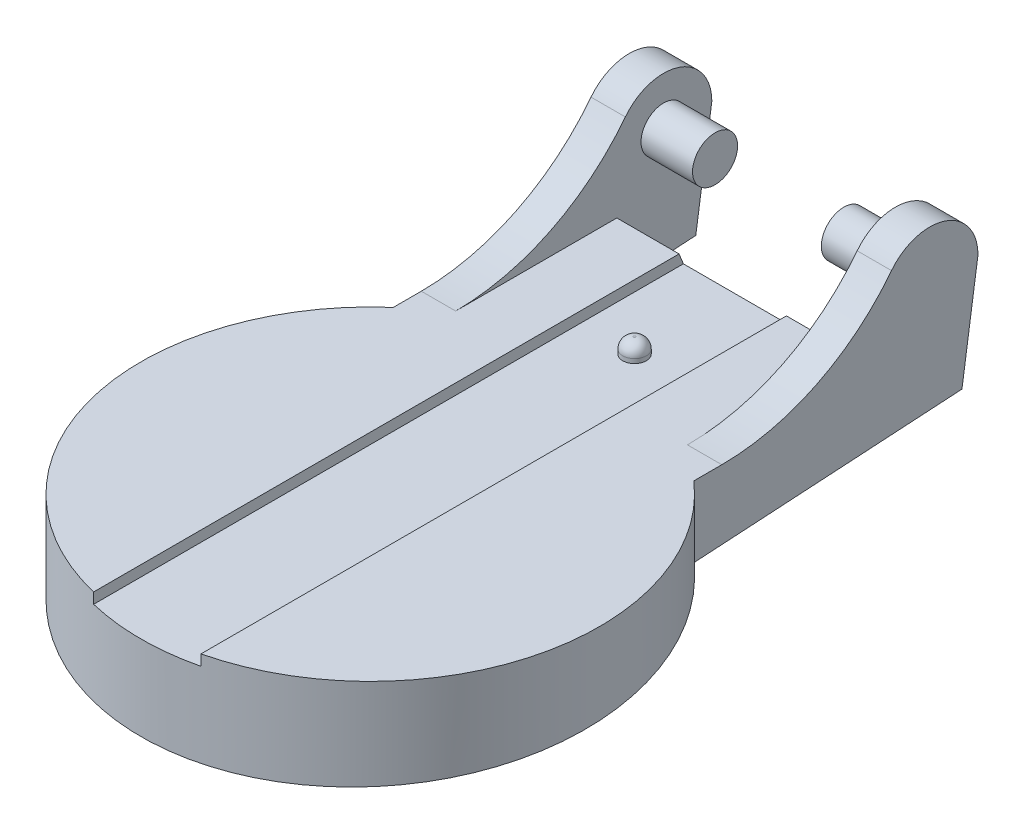
ISO-10303-21;
HEADER;
FILE_DESCRIPTION(('STEP AP214'),'2;1');
FILE_NAME('part.step','',(''),(''),'','','');
FILE_SCHEMA(('AUTOMOTIVE_DESIGN { 1 0 10303 214 1 1 1 1 }'));
ENDSEC;
DATA;
#1=APPLICATION_CONTEXT('core data for automotive mechanical design processes');
#2=APPLICATION_PROTOCOL_DEFINITION('international standard','automotive_design',2000,#1);
#3=PRODUCT_CONTEXT('',#1,'mechanical');
#4=PRODUCT('Part','Part','',(#3));
#5=PRODUCT_RELATED_PRODUCT_CATEGORY('part','',(#4));
#6=PRODUCT_DEFINITION_FORMATION('','',#4);
#7=PRODUCT_DEFINITION_CONTEXT('part definition',#1,'design');
#8=PRODUCT_DEFINITION('design','',#6,#7);
#9=PRODUCT_DEFINITION_SHAPE('','',#8);
#10=(LENGTH_UNIT() NAMED_UNIT(*) SI_UNIT(.MILLI.,.METRE.));
#11=(NAMED_UNIT(*) PLANE_ANGLE_UNIT() SI_UNIT($,.RADIAN.));
#12=(NAMED_UNIT(*) SI_UNIT($,.STERADIAN.) SOLID_ANGLE_UNIT());
#13=UNCERTAINTY_MEASURE_WITH_UNIT(LENGTH_MEASURE(1.E-05),#10,'distance_accuracy_value','');
#14=(GEOMETRIC_REPRESENTATION_CONTEXT(3) GLOBAL_UNCERTAINTY_ASSIGNED_CONTEXT((#13)) GLOBAL_UNIT_ASSIGNED_CONTEXT((#10,
#11,#12)) REPRESENTATION_CONTEXT('',''));
#15=CARTESIAN_POINT('',(0.,0.,0.));
#16=DIRECTION('',(0.,0.,1.));
#17=DIRECTION('',(1.,0.,0.));
#18=AXIS2_PLACEMENT_3D('',#15,#16,#17);
#19=CARTESIAN_POINT('',(0.,5.,0.));
#20=DIRECTION('',(0.,1.,0.));
#21=DIRECTION('',(0.,0.,1.));
#22=AXIS2_PLACEMENT_3D('',#19,#20,#21);
#23=PLANE('',#22);
#24=DIRECTION('',(0.,0.,-1.));
#25=VECTOR('',#24,1.);
#26=CARTESIAN_POINT('',(5.4,5.,-9.26221822783077));
#27=LINE('',#26,#25);
#28=CARTESIAN_POINT('',(5.4,5.,-3.06431468609474));
#29=VERTEX_POINT('',#28);
#30=CARTESIAN_POINT('',(5.4,5.,-10.5737971615211));
#31=VERTEX_POINT('',#30);
#32=EDGE_CURVE('E348',#29,#31,#27,.T.);
#33=ORIENTED_EDGE('',*,*,#32,.T.);
#34=DIRECTION('',(-1.,0.,0.));
#35=VECTOR('',#34,1.);
#36=CARTESIAN_POINT('',(0.,5.,-10.5737971615211));
#37=LINE('',#36,#35);
#38=CARTESIAN_POINT('',(2.5,5.,-10.5737971615212));
#39=VERTEX_POINT('',#38);
#40=EDGE_CURVE('E315',#31,#39,#37,.T.);
#41=ORIENTED_EDGE('',*,*,#40,.T.);
#42=DIRECTION('',(0.,0.,-1.));
#43=VECTOR('',#42,1.);
#44=CARTESIAN_POINT('',(2.5,5.,0.));
#45=LINE('',#44,#43);
#46=CARTESIAN_POINT('',(2.5,5.,16.7017507777364));
#47=VERTEX_POINT('',#46);
#48=EDGE_CURVE('E398',#47,#39,#45,.T.);
#49=ORIENTED_EDGE('',*,*,#48,.F.);
#50=CARTESIAN_POINT('',(0.,5.,6.31426982340599));
#51=DIRECTION('',(0.,1.,0.));
#52=DIRECTION('',(0.,0.,1.));
#53=AXIS2_PLACEMENT_3D('',#50,#51,#52);
#54=CIRCLE('',#53,10.6840891318155);
#55=CARTESIAN_POINT('',(7.,5.,-1.75727033796209));
#56=VERTEX_POINT('',#55);
#57=EDGE_CURVE('E381',#47,#56,#54,.T.);
#58=ORIENTED_EDGE('',*,*,#57,.T.);
#59=DIRECTION('',(0.,0.,1.));
#60=VECTOR('',#59,1.);
#61=CARTESIAN_POINT('',(7.,5.,0.));
#62=LINE('',#61,#60);
#63=CARTESIAN_POINT('',(7.,5.,-3.06431468609474));
#64=VERTEX_POINT('',#63);
#65=EDGE_CURVE('E367',#64,#56,#62,.T.);
#66=ORIENTED_EDGE('',*,*,#65,.F.);
#67=DIRECTION('',(-1.,0.,0.));
#68=VECTOR('',#67,1.);
#69=CARTESIAN_POINT('',(0.,5.,-3.06431468609474));
#70=LINE('',#69,#68);
#71=EDGE_CURVE('E418',#64,#29,#70,.T.);
#72=ORIENTED_EDGE('',*,*,#71,.T.);
#73=EDGE_LOOP('',(#33,#41,#49,#58,#66,#72));
#74=FACE_BOUND('',#73,.T.);
#75=ADVANCED_FACE('F164',(#74),#23,.T.);
#76=DIRECTION('',(0.,0.,1.));
#77=VECTOR('',#76,1.);
#78=CARTESIAN_POINT('',(-2.5,5.,0.));
#79=LINE('',#78,#77);
#80=CARTESIAN_POINT('',(-2.5,5.,-10.5737971615212));
#81=VERTEX_POINT('',#80);
#82=CARTESIAN_POINT('',(-2.5,5.,16.7017507777364));
#83=VERTEX_POINT('',#82);
#84=EDGE_CURVE('E396',#81,#83,#79,.T.);
#85=ORIENTED_EDGE('',*,*,#84,.F.);
#86=DIRECTION('',(-1.,0.,0.));
#87=VECTOR('',#86,1.);
#88=CARTESIAN_POINT('',(0.,5.,-10.5737971615211));
#89=LINE('',#88,#87);
#90=CARTESIAN_POINT('',(-5.4,5.,-10.5737971615211));
#91=VERTEX_POINT('',#90);
#92=EDGE_CURVE('E307',#81,#91,#89,.T.);
#93=ORIENTED_EDGE('',*,*,#92,.T.);
#94=DIRECTION('',(0.,0.,1.));
#95=VECTOR('',#94,1.);
#96=CARTESIAN_POINT('',(-5.4,5.,-9.26221822783077));
#97=LINE('',#96,#95);
#98=CARTESIAN_POINT('',(-5.4,5.,-3.06431468609474));
#99=VERTEX_POINT('',#98);
#100=EDGE_CURVE('E287',#91,#99,#97,.T.);
#101=ORIENTED_EDGE('',*,*,#100,.T.);
#102=DIRECTION('',(1.,0.,0.));
#103=VECTOR('',#102,1.);
#104=CARTESIAN_POINT('',(0.,5.,-3.06431468609474));
#105=LINE('',#104,#103);
#106=CARTESIAN_POINT('',(-7.,5.,-3.06431468609474));
#107=VERTEX_POINT('',#106);
#108=EDGE_CURVE('E412',#99,#107,#105,.F.);
#109=ORIENTED_EDGE('',*,*,#108,.T.);
#110=DIRECTION('',(0.,0.,-1.));
#111=VECTOR('',#110,1.);
#112=CARTESIAN_POINT('',(-7.,5.,9.53699339238767));
#113=LINE('',#112,#111);
#114=CARTESIAN_POINT('',(-7.,5.,-1.75727033796209));
#115=VERTEX_POINT('',#114);
#116=EDGE_CURVE('E354',#115,#107,#113,.T.);
#117=ORIENTED_EDGE('',*,*,#116,.F.);
#118=EDGE_CURVE('E382',#115,#83,#54,.T.);
#119=ORIENTED_EDGE('',*,*,#118,.T.);
#120=EDGE_LOOP('',(#85,#93,#101,#109,#117,#119));
#121=FACE_BOUND('',#120,.T.);
#122=ADVANCED_FACE('F444',(#121),#23,.T.);
#123=CARTESIAN_POINT('',(10.6840891318155,2.5,-15.));
#124=DIRECTION('',(0.,0.998164741139127,0.0605569942010037));
#125=DIRECTION('',(0.,-0.0605569942010037,0.998164741139127));
#126=AXIS2_PLACEMENT_3D('',#123,#124,#125);
#127=PLANE('',#126);
#128=DIRECTION('',(0.,0.0605569942010037,-0.998164741139127));
#129=VECTOR('',#128,1.);
#130=CARTESIAN_POINT('',(-5.4,2.5,-15.));
#131=LINE('',#130,#129);
#132=CARTESIAN_POINT('',(-5.4,2.29727597325408,-11.6584871268897));
#133=VERTEX_POINT('',#132);
#134=CARTESIAN_POINT('',(-5.4,2.45465107455214,-14.252510811875));
#135=VERTEX_POINT('',#134);
#136=EDGE_CURVE('E284',#133,#135,#131,.T.);
#137=ORIENTED_EDGE('',*,*,#136,.F.);
#138=DIRECTION('',(-1.,0.,0.));
#139=VECTOR('',#138,1.);
#140=CARTESIAN_POINT('',(13.6652872861874,2.29727597325408,-11.6584871268897));
#141=LINE('',#140,#139);
#142=CARTESIAN_POINT('',(5.4,2.29727597325408,-11.6584871268897));
#143=VERTEX_POINT('',#142);
#144=EDGE_CURVE('E290',#143,#133,#141,.T.);
#145=ORIENTED_EDGE('',*,*,#144,.F.);
#146=DIRECTION('',(0.,-0.0605569942010037,0.998164741139127));
#147=VECTOR('',#146,1.);
#148=CARTESIAN_POINT('',(5.4,2.5,-15.));
#149=LINE('',#148,#147);
#150=CARTESIAN_POINT('',(5.4,2.45465107455214,-14.252510811875));
#151=VERTEX_POINT('',#150);
#152=EDGE_CURVE('E304',#151,#143,#149,.T.);
#153=ORIENTED_EDGE('',*,*,#152,.F.);
#154=DIRECTION('',(-1.,0.,0.));
#155=VECTOR('',#154,1.);
#156=CARTESIAN_POINT('',(10.6840891318155,2.45465107455214,-14.252510811875));
#157=LINE('',#156,#155);
#158=CARTESIAN_POINT('',(7.,2.45465107455214,-14.252510811875));
#159=VERTEX_POINT('',#158);
#160=EDGE_CURVE('E321',#159,#151,#157,.T.);
#161=ORIENTED_EDGE('',*,*,#160,.F.);
#162=DIRECTION('',(0.,0.0605569942010038,-0.998164741139127));
#163=VECTOR('',#162,1.);
#164=CARTESIAN_POINT('',(7.,1.58414427952122,0.0961073979021152));
#165=LINE('',#164,#163);
#166=CARTESIAN_POINT('',(7.,1.69658562329671,-1.75727033796209));
#167=VERTEX_POINT('',#166);
#168=EDGE_CURVE('E369',#167,#159,#165,.T.);
#169=ORIENTED_EDGE('',*,*,#168,.F.);
#170=CARTESIAN_POINT('',(0.,1.20689871030546,6.31426982340599));
#171=DIRECTION('',(0.,0.998164741139127,0.0605569942010037));
#172=DIRECTION('',(0.,-0.0605569942010037,0.998164741139127));
#173=AXIS2_PLACEMENT_3D('',#170,#171,#172);
#174=ELLIPSE('',#173,10.7037332531127,10.6840891318155);
#175=CARTESIAN_POINT('',(-7.,1.69658562329671,-1.75727033796209));
#176=VERTEX_POINT('',#175);
#177=EDGE_CURVE('E379',#176,#167,#174,.T.);
#178=ORIENTED_EDGE('',*,*,#177,.F.);
#179=DIRECTION('',(0.,-0.0605569942010038,0.998164741139127));
#180=VECTOR('',#179,1.);
#181=CARTESIAN_POINT('',(-7.,1.58414427952122,0.0961073979021152));
#182=LINE('',#181,#180);
#183=CARTESIAN_POINT('',(-7.,2.45465107455214,-14.252510811875));
#184=VERTEX_POINT('',#183);
#185=EDGE_CURVE('E357',#184,#176,#182,.T.);
#186=ORIENTED_EDGE('',*,*,#185,.F.);
#187=EDGE_CURVE('E302',#135,#184,#157,.T.);
#188=ORIENTED_EDGE('',*,*,#187,.F.);
#189=EDGE_LOOP('',(#137,#145,#153,#161,#169,#178,#186,#188));
#190=FACE_BOUND('',#189,.T.);
#191=ADVANCED_FACE('F300',(#190),#127,.F.);
#192=CARTESIAN_POINT('',(0.,4.5,0.));
#193=DIRECTION('',(0.,1.,0.));
#194=DIRECTION('',(0.,0.,1.));
#195=AXIS2_PLACEMENT_3D('',#192,#193,#194);
#196=PLANE('',#195);
#197=CARTESIAN_POINT('',(0.,4.5,-6.));
#198=DIRECTION('',(0.,1.,0.));
#199=DIRECTION('',(0.,0.,1.));
#200=AXIS2_PLACEMENT_3D('',#197,#198,#199);
#201=CIRCLE('',#200,0.550000000000003);
#202=CARTESIAN_POINT('',(0.,4.5,-5.45));
#203=VERTEX_POINT('',#202);
#204=EDGE_CURVE('E330',#203,#203,#201,.T.);
#205=ORIENTED_EDGE('',*,*,#204,.F.);
#206=EDGE_LOOP('',(#205));
#207=FACE_BOUND('',#206,.T.);
#208=DIRECTION('',(0.,0.,-1.));
#209=VECTOR('',#208,1.);
#210=CARTESIAN_POINT('',(2.5,4.5,-52.5680480525767));
#211=LINE('',#210,#209);
#212=CARTESIAN_POINT('',(2.5,4.5,16.7017507777364));
#213=VERTEX_POINT('',#212);
#214=CARTESIAN_POINT('',(2.5,4.5,-10.77446322188));
#215=VERTEX_POINT('',#214);
#216=EDGE_CURVE('E333',#213,#215,#211,.T.);
#217=ORIENTED_EDGE('',*,*,#216,.T.);
#218=DIRECTION('',(-1.,0.,0.));
#219=VECTOR('',#218,1.);
#220=CARTESIAN_POINT('',(0.,4.5,-10.77446322188));
#221=LINE('',#220,#219);
#222=CARTESIAN_POINT('',(-2.5,4.5,-10.77446322188));
#223=VERTEX_POINT('',#222);
#224=EDGE_CURVE('E303',#215,#223,#221,.T.);
#225=ORIENTED_EDGE('',*,*,#224,.T.);
#226=DIRECTION('',(0.,0.,1.));
#227=VECTOR('',#226,1.);
#228=CARTESIAN_POINT('',(-2.5,4.5,-52.5680480525767));
#229=LINE('',#228,#227);
#230=CARTESIAN_POINT('',(-2.5,4.5,16.7017507777364));
#231=VERTEX_POINT('',#230);
#232=EDGE_CURVE('E336',#223,#231,#229,.T.);
#233=ORIENTED_EDGE('',*,*,#232,.T.);
#234=CARTESIAN_POINT('',(0.,4.5,6.31426982340599));
#235=DIRECTION('',(0.,1.,0.));
#236=DIRECTION('',(0.,0.,1.));
#237=AXIS2_PLACEMENT_3D('',#234,#235,#236);
#238=CIRCLE('',#237,10.6840891318155);
#239=EDGE_CURVE('E401',#231,#213,#238,.T.);
#240=ORIENTED_EDGE('',*,*,#239,.T.);
#241=EDGE_LOOP('',(#217,#225,#233,#240));
#242=FACE_BOUND('',#241,.T.);
#243=ADVANCED_FACE('F494',(#207,#242),#196,.T.);
#244=CARTESIAN_POINT('',(2.5,4.5,-52.5680480525767));
#245=DIRECTION('',(1.,0.,0.));
#246=DIRECTION('',(0.,0.,-1.));
#247=AXIS2_PLACEMENT_3D('',#244,#245,#246);
#248=PLANE('',#247);
#249=DIRECTION('',(0.,0.928049777726173,0.372456185426422));
#250=VECTOR('',#249,1.);
#251=CARTESIAN_POINT('',(2.5,-9.94628193426325,-16.5722201870435));
#252=LINE('',#251,#250);
#253=EDGE_CURVE('E313',#215,#39,#252,.T.);
#254=ORIENTED_EDGE('',*,*,#253,.F.);
#255=ORIENTED_EDGE('',*,*,#216,.F.);
#256=DIRECTION('',(0.,-1.,0.));
#257=VECTOR('',#256,1.);
#258=CARTESIAN_POINT('',(2.5,5.,16.7017507777364));
#259=LINE('',#258,#257);
#260=EDGE_CURVE('E341',#47,#213,#259,.T.);
#261=ORIENTED_EDGE('',*,*,#260,.F.);
#262=ORIENTED_EDGE('',*,*,#48,.T.);
#263=EDGE_LOOP('',(#254,#255,#261,#262));
#264=FACE_BOUND('',#263,.T.);
#265=ADVANCED_FACE('F497',(#264),#248,.F.);
#266=CARTESIAN_POINT('',(-2.5,4.5,-52.5680480525767));
#267=DIRECTION('',(-1.,0.,0.));
#268=DIRECTION('',(0.,0.,1.));
#269=AXIS2_PLACEMENT_3D('',#266,#267,#268);
#270=PLANE('',#269);
#271=DIRECTION('',(0.,-0.928049777726173,-0.372456185426422));
#272=VECTOR('',#271,1.);
#273=CARTESIAN_POINT('',(-2.5,-9.94628193426325,-16.5722201870435));
#274=LINE('',#273,#272);
#275=EDGE_CURVE('E12',#81,#223,#274,.T.);
#276=ORIENTED_EDGE('',*,*,#275,.F.);
#277=ORIENTED_EDGE('',*,*,#84,.T.);
#278=DIRECTION('',(0.,-1.,0.));
#279=VECTOR('',#278,1.);
#280=CARTESIAN_POINT('',(-2.5,5.,16.7017507777364));
#281=LINE('',#280,#279);
#282=EDGE_CURVE('E338',#231,#83,#281,.F.);
#283=ORIENTED_EDGE('',*,*,#282,.F.);
#284=ORIENTED_EDGE('',*,*,#232,.F.);
#285=EDGE_LOOP('',(#276,#277,#283,#284));
#286=FACE_BOUND('',#285,.T.);
#287=ADVANCED_FACE('F513',(#286),#270,.F.);
#288=CARTESIAN_POINT('',(10.6840891318155,7.5,-15.));
#289=DIRECTION('',(0.,0.146554433527509,0.989202607160652));
#290=DIRECTION('',(0.,-0.989202607160652,0.146554433527509));
#291=AXIS2_PLACEMENT_3D('',#288,#289,#290);
#292=PLANE('',#291);
#293=DIRECTION('',(0.,-0.989202607160652,0.146554433527509));
#294=VECTOR('',#293,1.);
#295=CARTESIAN_POINT('',(-5.4,33.5775315871492,-18.8634935268925));
#296=LINE('',#295,#294);
#297=CARTESIAN_POINT('',(-5.4,7.5,-15.));
#298=VERTEX_POINT('',#297);
#299=EDGE_CURVE('E324',#298,#135,#296,.T.);
#300=ORIENTED_EDGE('',*,*,#299,.T.);
#301=ORIENTED_EDGE('',*,*,#187,.T.);
#302=DIRECTION('',(0.,0.989202607160652,-0.146554433527509));
#303=VECTOR('',#302,1.);
#304=CARTESIAN_POINT('',(-7.,7.5,-15.));
#305=LINE('',#304,#303);
#306=CARTESIAN_POINT('',(-7.,7.5,-15.));
#307=VERTEX_POINT('',#306);
#308=EDGE_CURVE('E318',#184,#307,#305,.T.);
#309=ORIENTED_EDGE('',*,*,#308,.T.);
#310=DIRECTION('',(1.,0.,0.));
#311=VECTOR('',#310,1.);
#312=CARTESIAN_POINT('',(-7.,7.5,-15.));
#313=LINE('',#312,#311);
#314=EDGE_CURVE('E359',#307,#298,#313,.T.);
#315=ORIENTED_EDGE('',*,*,#314,.T.);
#316=EDGE_LOOP('',(#300,#301,#309,#315));
#317=FACE_BOUND('',#316,.T.);
#318=ADVANCED_FACE('F522',(#317),#292,.F.);
#319=ORIENTED_EDGE('',*,*,#160,.T.);
#320=DIRECTION('',(0.,0.989202607160652,-0.146554433527509));
#321=VECTOR('',#320,1.);
#322=CARTESIAN_POINT('',(5.4,33.5775315871492,-18.8634935268925));
#323=LINE('',#322,#321);
#324=CARTESIAN_POINT('',(5.4,7.5,-15.));
#325=VERTEX_POINT('',#324);
#326=EDGE_CURVE('E326',#151,#325,#323,.T.);
#327=ORIENTED_EDGE('',*,*,#326,.T.);
#328=DIRECTION('',(-1.,0.,0.));
#329=VECTOR('',#328,1.);
#330=CARTESIAN_POINT('',(7.,7.5,-15.));
#331=LINE('',#330,#329);
#332=CARTESIAN_POINT('',(7.,7.5,-15.));
#333=VERTEX_POINT('',#332);
#334=EDGE_CURVE('E372',#333,#325,#331,.T.);
#335=ORIENTED_EDGE('',*,*,#334,.F.);
#336=DIRECTION('',(0.,-0.989202607160652,0.146554433527509));
#337=VECTOR('',#336,1.);
#338=CARTESIAN_POINT('',(7.,-2.0134939011462,-13.5905367621787));
#339=LINE('',#338,#337);
#340=EDGE_CURVE('E328',#333,#159,#339,.T.);
#341=ORIENTED_EDGE('',*,*,#340,.T.);
#342=EDGE_LOOP('',(#319,#327,#335,#341));
#343=FACE_BOUND('',#342,.T.);
#344=ADVANCED_FACE('F475',(#343),#292,.F.);
#345=CARTESIAN_POINT('',(-3.,7.5,-12.75));
#346=DIRECTION('',(-1.,0.,0.));
#347=DIRECTION('',(0.,0.,1.));
#348=AXIS2_PLACEMENT_3D('',#345,#346,#347);
#349=CYLINDRICAL_SURFACE('',#348,1.05);
#350=CARTESIAN_POINT('',(-5.4,7.5,-12.75));
#351=DIRECTION('',(1.,0.,0.));
#352=DIRECTION('',(0.,0.,-1.));
#353=AXIS2_PLACEMENT_3D('',#350,#351,#352);
#354=CIRCLE('',#353,1.05);
#355=CARTESIAN_POINT('',(-5.4,7.5,-13.8));
#356=VERTEX_POINT('',#355);
#357=EDGE_CURVE('E393',#356,#356,#354,.F.);
#358=ORIENTED_EDGE('',*,*,#357,.F.);
#359=EDGE_LOOP('',(#358));
#360=FACE_BOUND('',#359,.T.);
#361=CARTESIAN_POINT('',(-3.,7.5,-12.75));
#362=DIRECTION('',(-1.,0.,0.));
#363=DIRECTION('',(0.,0.,1.));
#364=AXIS2_PLACEMENT_3D('',#361,#362,#363);
#365=CIRCLE('',#364,1.05);
#366=CARTESIAN_POINT('',(-3.,7.5,-11.7));
#367=VERTEX_POINT('',#366);
#368=EDGE_CURVE('E390',#367,#367,#365,.T.);
#369=ORIENTED_EDGE('',*,*,#368,.T.);
#370=EDGE_LOOP('',(#369));
#371=FACE_BOUND('',#370,.T.);
#372=ADVANCED_FACE('F465',(#360,#371),#349,.T.);
#373=CARTESIAN_POINT('',(-3.,7.5,-12.75));
#374=DIRECTION('',(-1.,0.,0.));
#375=DIRECTION('',(0.,0.,1.));
#376=AXIS2_PLACEMENT_3D('',#373,#374,#375);
#377=PLANE('',#376);
#378=ORIENTED_EDGE('',*,*,#368,.F.);
#379=EDGE_LOOP('',(#378));
#380=FACE_BOUND('',#379,.T.);
#381=ADVANCED_FACE('F462',(#380),#377,.F.);
#382=CARTESIAN_POINT('',(-5.4,35.,-9.26221822783077));
#383=DIRECTION('',(1.,0.,0.));
#384=DIRECTION('',(0.,0.,-1.));
#385=AXIS2_PLACEMENT_3D('',#382,#383,#384);
#386=PLANE('',#385);
#387=ORIENTED_EDGE('',*,*,#100,.F.);
#388=DIRECTION('',(0.,-0.928049777726173,-0.372456185426422));
#389=VECTOR('',#388,1.);
#390=CARTESIAN_POINT('',(-5.4,6.05915935724947,-10.1487224904982));
#391=LINE('',#390,#389);
#392=EDGE_CURVE('E278',#91,#133,#391,.T.);
#393=ORIENTED_EDGE('',*,*,#392,.T.);
#394=ORIENTED_EDGE('',*,*,#136,.T.);
#395=ORIENTED_EDGE('',*,*,#299,.F.);
#396=CARTESIAN_POINT('',(-5.4,7.5,-12.75));
#397=DIRECTION('',(1.,0.,0.));
#398=DIRECTION('',(0.,0.,-1.));
#399=AXIS2_PLACEMENT_3D('',#396,#397,#398);
#400=CIRCLE('',#399,2.25);
#401=CARTESIAN_POINT('',(-5.4,8.87755102040817,-10.970996574997));
#402=VERTEX_POINT('',#401);
#403=EDGE_CURVE('E351',#298,#402,#400,.T.);
#404=ORIENTED_EDGE('',*,*,#403,.T.);
#405=CARTESIAN_POINT('',(-5.4,15.,-3.06431468609474));
#406=DIRECTION('',(1.,0.,0.));
#407=DIRECTION('',(0.,0.,-1.));
#408=AXIS2_PLACEMENT_3D('',#405,#406,#407);
#409=CIRCLE('',#408,10.);
#410=EDGE_CURVE('E414',#402,#99,#409,.F.);
#411=ORIENTED_EDGE('',*,*,#410,.T.);
#412=EDGE_LOOP('',(#387,#393,#394,#395,#404,#411));
#413=FACE_BOUND('',#412,.T.);
#414=ORIENTED_EDGE('',*,*,#357,.T.);
#415=EDGE_LOOP('',(#414));
#416=FACE_BOUND('',#415,.T.);
#417=ADVANCED_FACE('F280',(#413,#416),#386,.T.);
#418=CARTESIAN_POINT('',(7.,7.5,-12.75));
#419=DIRECTION('',(-1.,0.,0.));
#420=DIRECTION('',(0.,0.,1.));
#421=AXIS2_PLACEMENT_3D('',#418,#419,#420);
#422=CYLINDRICAL_SURFACE('',#421,2.25);
#423=CARTESIAN_POINT('',(5.4,7.5,-12.75));
#424=DIRECTION('',(-1.,0.,0.));
#425=DIRECTION('',(0.,0.,1.));
#426=AXIS2_PLACEMENT_3D('',#423,#424,#425);
#427=CIRCLE('',#426,2.25);
#428=CARTESIAN_POINT('',(5.4,8.87755102040816,-10.970996574997));
#429=VERTEX_POINT('',#428);
#430=EDGE_CURVE('E385',#429,#325,#427,.T.);
#431=ORIENTED_EDGE('',*,*,#430,.F.);
#432=DIRECTION('',(-1.,0.,0.));
#433=VECTOR('',#432,1.);
#434=CARTESIAN_POINT('',(7.,8.87755102040816,-10.970996574997));
#435=LINE('',#434,#433);
#436=CARTESIAN_POINT('',(7.,8.87755102040816,-10.970996574997));
#437=VERTEX_POINT('',#436);
#438=EDGE_CURVE('E179',#429,#437,#435,.F.);
#439=ORIENTED_EDGE('',*,*,#438,.T.);
#440=CARTESIAN_POINT('',(7.,7.5,-12.75));
#441=DIRECTION('',(1.,0.,0.));
#442=DIRECTION('',(0.,0.,-1.));
#443=AXIS2_PLACEMENT_3D('',#440,#441,#442);
#444=CIRCLE('',#443,2.25);
#445=EDGE_CURVE('E366',#333,#437,#444,.T.);
#446=ORIENTED_EDGE('',*,*,#445,.F.);
#447=ORIENTED_EDGE('',*,*,#334,.T.);
#448=EDGE_LOOP('',(#431,#439,#446,#447));
#449=FACE_BOUND('',#448,.T.);
#450=ADVANCED_FACE('F461',(#449),#422,.T.);
#451=CARTESIAN_POINT('',(-7.,7.5,-12.75));
#452=DIRECTION('',(1.,0.,0.));
#453=DIRECTION('',(0.,0.,-1.));
#454=AXIS2_PLACEMENT_3D('',#451,#452,#453);
#455=CYLINDRICAL_SURFACE('',#454,2.25);
#456=CARTESIAN_POINT('',(-7.,7.5,-12.75));
#457=DIRECTION('',(-1.,0.,0.));
#458=DIRECTION('',(0.,0.,1.));
#459=AXIS2_PLACEMENT_3D('',#456,#457,#458);
#460=CIRCLE('',#459,2.25);
#461=CARTESIAN_POINT('',(-7.,8.87755102040817,-10.970996574997));
#462=VERTEX_POINT('',#461);
#463=EDGE_CURVE('E355',#462,#307,#460,.T.);
#464=ORIENTED_EDGE('',*,*,#463,.F.);
#465=DIRECTION('',(1.,0.,0.));
#466=VECTOR('',#465,1.);
#467=CARTESIAN_POINT('',(-7.,8.87755102040817,-10.970996574997));
#468=LINE('',#467,#466);
#469=EDGE_CURVE('E409',#462,#402,#468,.T.);
#470=ORIENTED_EDGE('',*,*,#469,.T.);
#471=ORIENTED_EDGE('',*,*,#403,.F.);
#472=ORIENTED_EDGE('',*,*,#314,.F.);
#473=EDGE_LOOP('',(#464,#470,#471,#472));
#474=FACE_BOUND('',#473,.T.);
#475=ADVANCED_FACE('F457',(#474),#455,.T.);
#476=CARTESIAN_POINT('',(0.,5.,6.31426982340599));
#477=DIRECTION('',(0.,-1.,0.));
#478=DIRECTION('',(0.,0.,-1.));
#479=AXIS2_PLACEMENT_3D('',#476,#477,#478);
#480=CYLINDRICAL_SURFACE('',#479,10.6840891318155);
#481=ORIENTED_EDGE('',*,*,#57,.F.);
#482=ORIENTED_EDGE('',*,*,#260,.T.);
#483=ORIENTED_EDGE('',*,*,#239,.F.);
#484=ORIENTED_EDGE('',*,*,#282,.T.);
#485=ORIENTED_EDGE('',*,*,#118,.F.);
#486=DIRECTION('',(0.,-1.,0.));
#487=VECTOR('',#486,1.);
#488=CARTESIAN_POINT('',(-7.,5.,-1.75727033796209));
#489=LINE('',#488,#487);
#490=EDGE_CURVE('E361',#115,#176,#489,.T.);
#491=ORIENTED_EDGE('',*,*,#490,.T.);
#492=ORIENTED_EDGE('',*,*,#177,.T.);
#493=DIRECTION('',(0.,-1.,0.));
#494=VECTOR('',#493,1.);
#495=CARTESIAN_POINT('',(7.,5.,-1.75727033796209));
#496=LINE('',#495,#494);
#497=EDGE_CURVE('E375',#167,#56,#496,.F.);
#498=ORIENTED_EDGE('',*,*,#497,.T.);
#499=EDGE_LOOP('',(#481,#482,#483,#484,#485,#491,#492,#498));
#500=FACE_BOUND('',#499,.T.);
#501=ADVANCED_FACE('F454',(#500),#480,.T.);
#502=CARTESIAN_POINT('',(7.,0.,0.));
#503=DIRECTION('',(1.,0.,0.));
#504=DIRECTION('',(0.,0.,-1.));
#505=AXIS2_PLACEMENT_3D('',#502,#503,#504);
#506=PLANE('',#505);
#507=ORIENTED_EDGE('',*,*,#340,.F.);
#508=ORIENTED_EDGE('',*,*,#445,.T.);
#509=CARTESIAN_POINT('',(7.,15.,-3.06431468609474));
#510=DIRECTION('',(1.,0.,0.));
#511=DIRECTION('',(0.,0.,-1.));
#512=AXIS2_PLACEMENT_3D('',#509,#510,#511);
#513=CIRCLE('',#512,10.);
#514=EDGE_CURVE('E172',#437,#64,#513,.F.);
#515=ORIENTED_EDGE('',*,*,#514,.T.);
#516=ORIENTED_EDGE('',*,*,#65,.T.);
#517=ORIENTED_EDGE('',*,*,#497,.F.);
#518=ORIENTED_EDGE('',*,*,#168,.T.);
#519=EDGE_LOOP('',(#507,#508,#515,#516,#517,#518));
#520=FACE_BOUND('',#519,.T.);
#521=ADVANCED_FACE('F426',(#520),#506,.T.);
#522=CARTESIAN_POINT('',(5.4,35.,-9.26221822783077));
#523=DIRECTION('',(-1.,0.,0.));
#524=DIRECTION('',(0.,0.,1.));
#525=AXIS2_PLACEMENT_3D('',#522,#523,#524);
#526=PLANE('',#525);
#527=ORIENTED_EDGE('',*,*,#326,.F.);
#528=ORIENTED_EDGE('',*,*,#152,.T.);
#529=DIRECTION('',(0.,0.928049777726173,0.372456185426422));
#530=VECTOR('',#529,1.);
#531=CARTESIAN_POINT('',(5.4,6.05915935724947,-10.1487224904982));
#532=LINE('',#531,#530);
#533=EDGE_CURVE('E296',#143,#31,#532,.T.);
#534=ORIENTED_EDGE('',*,*,#533,.T.);
#535=ORIENTED_EDGE('',*,*,#32,.F.);
#536=CARTESIAN_POINT('',(5.4,15.,-3.06431468609474));
#537=DIRECTION('',(-1.,0.,0.));
#538=DIRECTION('',(0.,0.,1.));
#539=AXIS2_PLACEMENT_3D('',#536,#537,#538);
#540=CIRCLE('',#539,10.);
#541=EDGE_CURVE('E187',#29,#429,#540,.F.);
#542=ORIENTED_EDGE('',*,*,#541,.T.);
#543=ORIENTED_EDGE('',*,*,#430,.T.);
#544=EDGE_LOOP('',(#527,#528,#534,#535,#542,#543));
#545=FACE_BOUND('',#544,.T.);
#546=CARTESIAN_POINT('',(5.4,7.5,-12.75));
#547=DIRECTION('',(-1.,0.,0.));
#548=DIRECTION('',(0.,0.,1.));
#549=AXIS2_PLACEMENT_3D('',#546,#547,#548);
#550=CIRCLE('',#549,1.05);
#551=CARTESIAN_POINT('',(5.4,7.5,-11.7));
#552=VERTEX_POINT('',#551);
#553=EDGE_CURVE('E387',#552,#552,#550,.T.);
#554=ORIENTED_EDGE('',*,*,#553,.F.);
#555=EDGE_LOOP('',(#554));
#556=FACE_BOUND('',#555,.T.);
#557=ADVANCED_FACE('F508',(#545,#556),#526,.T.);
#558=CARTESIAN_POINT('',(3.,7.5,-12.75));
#559=DIRECTION('',(1.,0.,0.));
#560=DIRECTION('',(0.,0.,-1.));
#561=AXIS2_PLACEMENT_3D('',#558,#559,#560);
#562=CYLINDRICAL_SURFACE('',#561,1.05);
#563=ORIENTED_EDGE('',*,*,#553,.T.);
#564=EDGE_LOOP('',(#563));
#565=FACE_BOUND('',#564,.T.);
#566=CARTESIAN_POINT('',(3.,7.5,-12.75));
#567=DIRECTION('',(1.,0.,0.));
#568=DIRECTION('',(0.,0.,-1.));
#569=AXIS2_PLACEMENT_3D('',#566,#567,#568);
#570=CIRCLE('',#569,1.05);
#571=CARTESIAN_POINT('',(3.,7.5,-13.8));
#572=VERTEX_POINT('',#571);
#573=EDGE_CURVE('E344',#572,#572,#570,.T.);
#574=ORIENTED_EDGE('',*,*,#573,.T.);
#575=EDGE_LOOP('',(#574));
#576=FACE_BOUND('',#575,.T.);
#577=ADVANCED_FACE('F539',(#565,#576),#562,.T.);
#578=CARTESIAN_POINT('',(3.,7.5,-12.75));
#579=DIRECTION('',(1.,0.,0.));
#580=DIRECTION('',(0.,0.,-1.));
#581=AXIS2_PLACEMENT_3D('',#578,#579,#580);
#582=PLANE('',#581);
#583=ORIENTED_EDGE('',*,*,#573,.F.);
#584=EDGE_LOOP('',(#583));
#585=FACE_BOUND('',#584,.T.);
#586=ADVANCED_FACE('F471',(#585),#582,.F.);
#587=CARTESIAN_POINT('',(-7.,7.5,-12.75));
#588=DIRECTION('',(-1.,0.,0.));
#589=DIRECTION('',(0.,0.,1.));
#590=AXIS2_PLACEMENT_3D('',#587,#588,#589);
#591=PLANE('',#590);
#592=ORIENTED_EDGE('',*,*,#308,.F.);
#593=ORIENTED_EDGE('',*,*,#185,.T.);
#594=ORIENTED_EDGE('',*,*,#490,.F.);
#595=ORIENTED_EDGE('',*,*,#116,.T.);
#596=CARTESIAN_POINT('',(-7.,15.,-3.06431468609474));
#597=DIRECTION('',(-1.,0.,0.));
#598=DIRECTION('',(0.,0.,1.));
#599=AXIS2_PLACEMENT_3D('',#596,#597,#598);
#600=CIRCLE('',#599,10.);
#601=EDGE_CURVE('E416',#107,#462,#600,.F.);
#602=ORIENTED_EDGE('',*,*,#601,.T.);
#603=ORIENTED_EDGE('',*,*,#463,.T.);
#604=EDGE_LOOP('',(#592,#593,#594,#595,#602,#603));
#605=FACE_BOUND('',#604,.T.);
#606=ADVANCED_FACE('F467',(#605),#591,.T.);
#607=CARTESIAN_POINT('',(0.,5.2,-6.));
#608=DIRECTION('',(0.,-1.,0.));
#609=DIRECTION('',(0.,0.,-1.));
#610=AXIS2_PLACEMENT_3D('',#607,#608,#609);
#611=CYLINDRICAL_SURFACE('',#610,0.550000000000003);
#612=CARTESIAN_POINT('',(0.,4.7,-6.));
#613=DIRECTION('',(0.,1.,0.));
#614=DIRECTION('',(0.,0.,1.));
#615=AXIS2_PLACEMENT_3D('',#612,#613,#614);
#616=CIRCLE('',#615,0.550000000000003);
#617=CARTESIAN_POINT('',(0.,4.7,-5.45));
#618=VERTEX_POINT('',#617);
#619=EDGE_CURVE('E406',#618,#618,#616,.F.);
#620=ORIENTED_EDGE('',*,*,#619,.T.);
#621=EDGE_LOOP('',(#620));
#622=FACE_BOUND('',#621,.T.);
#623=ORIENTED_EDGE('',*,*,#204,.T.);
#624=EDGE_LOOP('',(#623));
#625=FACE_BOUND('',#624,.T.);
#626=ADVANCED_FACE('F470',(#622,#625),#611,.T.);
#627=CARTESIAN_POINT('',(0.,5.2,-6.));
#628=DIRECTION('',(0.,1.,0.));
#629=DIRECTION('',(0.,0.,1.));
#630=AXIS2_PLACEMENT_3D('',#627,#628,#629);
#631=PLANE('',#630);
#632=CARTESIAN_POINT('',(0.,5.2,-6.));
#633=DIRECTION('',(0.,1.,0.));
#634=DIRECTION('',(0.,0.,1.));
#635=AXIS2_PLACEMENT_3D('',#632,#633,#634);
#636=CIRCLE('',#635,0.0500000000000033);
#637=CARTESIAN_POINT('',(0.,5.2,-5.95));
#638=VERTEX_POINT('',#637);
#639=EDGE_CURVE('E403',#638,#638,#636,.T.);
#640=ORIENTED_EDGE('',*,*,#639,.T.);
#641=EDGE_LOOP('',(#640));
#642=FACE_BOUND('',#641,.T.);
#643=ADVANCED_FACE('F478',(#642),#631,.T.);
#644=CARTESIAN_POINT('',(0.,4.7,-6.));
#645=DIRECTION('',(0.,1.,0.));
#646=DIRECTION('',(0.,0.,1.));
#647=AXIS2_PLACEMENT_3D('',#644,#645,#646);
#648=DEGENERATE_TOROIDAL_SURFACE('',#647,0.0500000000000033,0.5,.T.);
#649=ORIENTED_EDGE('',*,*,#619,.F.);
#650=EDGE_LOOP('',(#649));
#651=FACE_BOUND('',#650,.T.);
#652=ORIENTED_EDGE('',*,*,#639,.F.);
#653=EDGE_LOOP('',(#652));
#654=FACE_BOUND('',#653,.T.);
#655=ADVANCED_FACE('F441',(#651,#654),#648,.T.);
#656=CARTESIAN_POINT('',(-7.,15.,-3.06431468609474));
#657=DIRECTION('',(1.,0.,0.));
#658=DIRECTION('',(0.,0.,-1.));
#659=AXIS2_PLACEMENT_3D('',#656,#657,#658);
#660=CYLINDRICAL_SURFACE('',#659,10.);
#661=ORIENTED_EDGE('',*,*,#601,.F.);
#662=ORIENTED_EDGE('',*,*,#108,.F.);
#663=ORIENTED_EDGE('',*,*,#410,.F.);
#664=ORIENTED_EDGE('',*,*,#469,.F.);
#665=EDGE_LOOP('',(#661,#662,#663,#664));
#666=FACE_BOUND('',#665,.T.);
#667=ADVANCED_FACE('F435',(#666),#660,.F.);
#668=CARTESIAN_POINT('',(7.,15.,-3.06431468609474));
#669=DIRECTION('',(-1.,0.,0.));
#670=DIRECTION('',(0.,0.,1.));
#671=AXIS2_PLACEMENT_3D('',#668,#669,#670);
#672=CYLINDRICAL_SURFACE('',#671,10.);
#673=ORIENTED_EDGE('',*,*,#514,.F.);
#674=ORIENTED_EDGE('',*,*,#438,.F.);
#675=ORIENTED_EDGE('',*,*,#541,.F.);
#676=ORIENTED_EDGE('',*,*,#71,.F.);
#677=EDGE_LOOP('',(#673,#674,#675,#676));
#678=FACE_BOUND('',#677,.T.);
#679=ADVANCED_FACE('F166',(#678),#672,.F.);
#680=CARTESIAN_POINT('',(13.6652872861874,6.05915935724947,-10.1487224904982));
#681=DIRECTION('',(0.,0.372456185426422,-0.928049777726173));
#682=DIRECTION('',(0.,0.928049777726173,0.372456185426422));
#683=AXIS2_PLACEMENT_3D('',#680,#681,#682);
#684=PLANE('',#683);
#685=ORIENTED_EDGE('',*,*,#533,.F.);
#686=ORIENTED_EDGE('',*,*,#144,.T.);
#687=ORIENTED_EDGE('',*,*,#392,.F.);
#688=ORIENTED_EDGE('',*,*,#92,.F.);
#689=ORIENTED_EDGE('',*,*,#275,.T.);
#690=ORIENTED_EDGE('',*,*,#224,.F.);
#691=ORIENTED_EDGE('',*,*,#253,.T.);
#692=ORIENTED_EDGE('',*,*,#40,.F.);
#693=EDGE_LOOP('',(#685,#686,#687,#688,#689,#690,#691,#692));
#694=FACE_BOUND('',#693,.T.);
#695=ADVANCED_FACE('F294',(#694),#684,.T.);
#696=CLOSED_SHELL('',(#75,#122,#191,#243,#265,#287,#318,#344,#372,#381,#417,#450,#475,#501,#521,
#557,#577,#586,#606,#626,#643,#655,#667,#679,#695));
#697=MANIFOLD_SOLID_BREP('B2',#696);
#698=ADVANCED_BREP_SHAPE_REPRESENTATION('',(#18,#697),#14);
#699=SHAPE_DEFINITION_REPRESENTATION(#9,#698);
ENDSEC;
END-ISO-10303-21;
